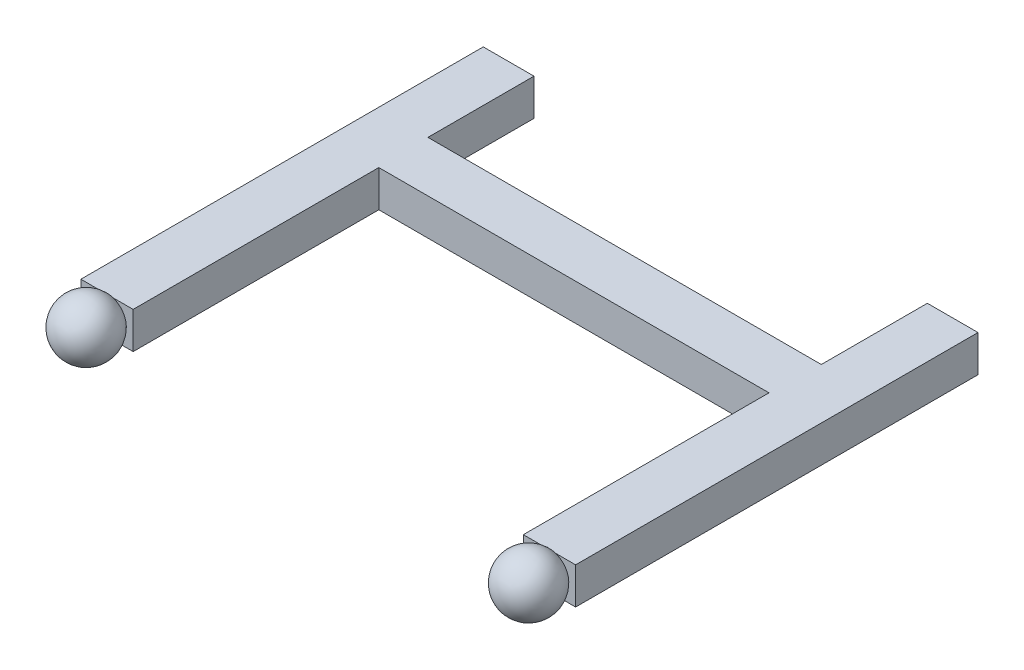
ISO-10303-21;
HEADER;
FILE_DESCRIPTION(('STEP AP214'),'2;1');
FILE_NAME('part.step','',(''),(''),'','','');
FILE_SCHEMA(('AUTOMOTIVE_DESIGN { 1 0 10303 214 1 1 1 1 }'));
ENDSEC;
DATA;
#1=APPLICATION_CONTEXT('core data for automotive mechanical design processes');
#2=APPLICATION_PROTOCOL_DEFINITION('international standard','automotive_design',2000,#1);
#3=PRODUCT_CONTEXT('',#1,'mechanical');
#4=PRODUCT('Part','Part','',(#3));
#5=PRODUCT_RELATED_PRODUCT_CATEGORY('part','',(#4));
#6=PRODUCT_DEFINITION_FORMATION('','',#4);
#7=PRODUCT_DEFINITION_CONTEXT('part definition',#1,'design');
#8=PRODUCT_DEFINITION('design','',#6,#7);
#9=PRODUCT_DEFINITION_SHAPE('','',#8);
#10=(LENGTH_UNIT() NAMED_UNIT(*) SI_UNIT(.MILLI.,.METRE.));
#11=(NAMED_UNIT(*) PLANE_ANGLE_UNIT() SI_UNIT($,.RADIAN.));
#12=(NAMED_UNIT(*) SI_UNIT($,.STERADIAN.) SOLID_ANGLE_UNIT());
#13=UNCERTAINTY_MEASURE_WITH_UNIT(LENGTH_MEASURE(1.E-05),#10,'distance_accuracy_value','');
#14=(GEOMETRIC_REPRESENTATION_CONTEXT(3) GLOBAL_UNCERTAINTY_ASSIGNED_CONTEXT((#13)) GLOBAL_UNIT_ASSIGNED_CONTEXT((#10,
#11,#12)) REPRESENTATION_CONTEXT('',''));
#15=CARTESIAN_POINT('',(0.,0.,0.));
#16=DIRECTION('',(0.,0.,1.));
#17=DIRECTION('',(1.,0.,0.));
#18=AXIS2_PLACEMENT_3D('',#15,#16,#17);
#19=CARTESIAN_POINT('',(419.201637164409,7.,96.46));
#20=DIRECTION('',(0.,0.,-1.));
#21=DIRECTION('',(-1.,0.,0.));
#22=AXIS2_PLACEMENT_3D('',#19,#20,#21);
#23=PLANE('',#22);
#24=DIRECTION('',(0.,-1.,0.));
#25=VECTOR('',#24,1.);
#26=CARTESIAN_POINT('',(409.201637164409,7.,96.4600000000001));
#27=LINE('',#26,#25);
#28=CARTESIAN_POINT('',(409.201637164409,7.,96.46));
#29=VERTEX_POINT('',#28);
#30=CARTESIAN_POINT('',(409.201637164409,0.,96.46));
#31=VERTEX_POINT('',#30);
#32=EDGE_CURVE('E58',#29,#31,#27,.T.);
#33=ORIENTED_EDGE('',*,*,#32,.F.);
#34=DIRECTION('',(1.,0.,0.));
#35=VECTOR('',#34,1.);
#36=CARTESIAN_POINT('',(419.201637164409,7.,96.46));
#37=LINE('',#36,#35);
#38=CARTESIAN_POINT('',(334.545159977184,7.,96.4600000000001));
#39=VERTEX_POINT('',#38);
#40=EDGE_CURVE('E203',#39,#29,#37,.T.);
#41=ORIENTED_EDGE('',*,*,#40,.F.);
#42=DIRECTION('',(0.,1.,0.));
#43=VECTOR('',#42,1.);
#44=CARTESIAN_POINT('',(334.545159977184,7.,96.4600000000001));
#45=LINE('',#44,#43);
#46=CARTESIAN_POINT('',(334.545159977184,0.,96.46));
#47=VERTEX_POINT('',#46);
#48=EDGE_CURVE('E206',#47,#39,#45,.T.);
#49=ORIENTED_EDGE('',*,*,#48,.F.);
#50=DIRECTION('',(1.,0.,0.));
#51=VECTOR('',#50,1.);
#52=CARTESIAN_POINT('',(419.201637164409,0.,96.46));
#53=LINE('',#52,#51);
#54=EDGE_CURVE('E358',#47,#31,#53,.T.);
#55=ORIENTED_EDGE('',*,*,#54,.T.);
#56=EDGE_LOOP('',(#33,#41,#49,#55));
#57=FACE_BOUND('',#56,.T.);
#58=ADVANCED_FACE('F35',(#57),#23,.F.);
#59=CARTESIAN_POINT('',(324.545159977184,7.,66.47));
#60=DIRECTION('',(0.,0.,1.));
#61=DIRECTION('',(1.,0.,0.));
#62=AXIS2_PLACEMENT_3D('',#59,#60,#61);
#63=PLANE('',#62);
#64=DIRECTION('',(-1.,0.,0.));
#65=VECTOR('',#64,1.);
#66=CARTESIAN_POINT('',(324.545159977184,7.,66.47));
#67=LINE('',#66,#65);
#68=CARTESIAN_POINT('',(334.245159977184,7.,66.47));
#69=VERTEX_POINT('',#68);
#70=CARTESIAN_POINT('',(324.545159977184,7.,66.47));
#71=VERTEX_POINT('',#70);
#72=EDGE_CURVE('E344',#69,#71,#67,.T.);
#73=ORIENTED_EDGE('',*,*,#72,.F.);
#74=DIRECTION('',(0.,1.,0.));
#75=VECTOR('',#74,1.);
#76=CARTESIAN_POINT('',(334.245159977184,-77.,66.47));
#77=LINE('',#76,#75);
#78=CARTESIAN_POINT('',(334.245159977184,0.,66.47));
#79=VERTEX_POINT('',#78);
#80=EDGE_CURVE('E326',#79,#69,#77,.T.);
#81=ORIENTED_EDGE('',*,*,#80,.F.);
#82=DIRECTION('',(-1.,0.,0.));
#83=VECTOR('',#82,1.);
#84=CARTESIAN_POINT('',(324.545159977184,0.,66.47));
#85=LINE('',#84,#83);
#86=CARTESIAN_POINT('',(324.545159977184,0.,66.47));
#87=VERTEX_POINT('',#86);
#88=EDGE_CURVE('E343',#79,#87,#85,.T.);
#89=ORIENTED_EDGE('',*,*,#88,.T.);
#90=DIRECTION('',(0.,-1.,0.));
#91=VECTOR('',#90,1.);
#92=CARTESIAN_POINT('',(324.545159977184,7.,66.47));
#93=LINE('',#92,#91);
#94=EDGE_CURVE('E366',#71,#87,#93,.T.);
#95=ORIENTED_EDGE('',*,*,#94,.F.);
#96=EDGE_LOOP('',(#73,#81,#89,#95));
#97=FACE_BOUND('',#96,.T.);
#98=ADVANCED_FACE('F37',(#97),#63,.F.);
#99=CARTESIAN_POINT('',(324.545159977184,7.,96.46));
#100=DIRECTION('',(1.,0.,0.));
#101=DIRECTION('',(0.,0.,-1.));
#102=AXIS2_PLACEMENT_3D('',#99,#100,#101);
#103=PLANE('',#102);
#104=DIRECTION('',(0.,0.,1.));
#105=VECTOR('',#104,1.);
#106=CARTESIAN_POINT('',(324.545159977184,0.,96.46));
#107=LINE('',#106,#105);
#108=CARTESIAN_POINT('',(324.545159977184,0.,143.46));
#109=VERTEX_POINT('',#108);
#110=EDGE_CURVE('E356',#87,#109,#107,.T.);
#111=ORIENTED_EDGE('',*,*,#110,.T.);
#112=DIRECTION('',(0.,1.,0.));
#113=VECTOR('',#112,1.);
#114=CARTESIAN_POINT('',(324.545159977184,7.,143.46));
#115=LINE('',#114,#113);
#116=CARTESIAN_POINT('',(324.545159977184,7.,143.46));
#117=VERTEX_POINT('',#116);
#118=EDGE_CURVE('E267',#109,#117,#115,.T.);
#119=ORIENTED_EDGE('',*,*,#118,.T.);
#120=DIRECTION('',(0.,0.,1.));
#121=VECTOR('',#120,1.);
#122=CARTESIAN_POINT('',(324.545159977184,7.,96.46));
#123=LINE('',#122,#121);
#124=EDGE_CURVE('E346',#71,#117,#123,.T.);
#125=ORIENTED_EDGE('',*,*,#124,.F.);
#126=ORIENTED_EDGE('',*,*,#94,.T.);
#127=EDGE_LOOP('',(#111,#119,#125,#126));
#128=FACE_BOUND('',#127,.T.);
#129=ADVANCED_FACE('F390',(#128),#103,.F.);
#130=CARTESIAN_POINT('',(419.201637164409,7.,66.47));
#131=DIRECTION('',(-1.,0.,0.));
#132=DIRECTION('',(0.,0.,1.));
#133=AXIS2_PLACEMENT_3D('',#130,#131,#132);
#134=PLANE('',#133);
#135=DIRECTION('',(0.,0.,-1.));
#136=VECTOR('',#135,1.);
#137=CARTESIAN_POINT('',(419.201637164409,0.,66.47));
#138=LINE('',#137,#136);
#139=CARTESIAN_POINT('',(419.201637164409,0.,143.46));
#140=VERTEX_POINT('',#139);
#141=CARTESIAN_POINT('',(419.201637164409,0.,66.47));
#142=VERTEX_POINT('',#141);
#143=EDGE_CURVE('E360',#140,#142,#138,.T.);
#144=ORIENTED_EDGE('',*,*,#143,.T.);
#145=DIRECTION('',(0.,-1.,0.));
#146=VECTOR('',#145,1.);
#147=CARTESIAN_POINT('',(419.201637164409,7.,66.47));
#148=LINE('',#147,#146);
#149=CARTESIAN_POINT('',(419.201637164409,7.,66.47));
#150=VERTEX_POINT('',#149);
#151=EDGE_CURVE('E354',#150,#142,#148,.T.);
#152=ORIENTED_EDGE('',*,*,#151,.F.);
#153=DIRECTION('',(0.,0.,-1.));
#154=VECTOR('',#153,1.);
#155=CARTESIAN_POINT('',(419.201637164409,7.,66.47));
#156=LINE('',#155,#154);
#157=CARTESIAN_POINT('',(419.201637164409,7.,143.46));
#158=VERTEX_POINT('',#157);
#159=EDGE_CURVE('E350',#158,#150,#156,.T.);
#160=ORIENTED_EDGE('',*,*,#159,.F.);
#161=DIRECTION('',(0.,-1.,0.));
#162=VECTOR('',#161,1.);
#163=CARTESIAN_POINT('',(419.201637164409,7.,143.46));
#164=LINE('',#163,#162);
#165=EDGE_CURVE('E216',#158,#140,#164,.T.);
#166=ORIENTED_EDGE('',*,*,#165,.T.);
#167=EDGE_LOOP('',(#144,#152,#160,#166));
#168=FACE_BOUND('',#167,.T.);
#169=ADVANCED_FACE('F453',(#168),#134,.F.);
#170=CARTESIAN_POINT('',(409.201637164409,7.,66.47));
#171=DIRECTION('',(0.,0.,1.));
#172=DIRECTION('',(1.,0.,0.));
#173=AXIS2_PLACEMENT_3D('',#170,#171,#172);
#174=PLANE('',#173);
#175=DIRECTION('',(-1.,0.,0.));
#176=VECTOR('',#175,1.);
#177=CARTESIAN_POINT('',(409.201637164409,0.,66.47));
#178=LINE('',#177,#176);
#179=CARTESIAN_POINT('',(409.512200166775,0.,66.47));
#180=VERTEX_POINT('',#179);
#181=EDGE_CURVE('E347',#142,#180,#178,.T.);
#182=ORIENTED_EDGE('',*,*,#181,.T.);
#183=DIRECTION('',(0.,1.,0.));
#184=VECTOR('',#183,1.);
#185=CARTESIAN_POINT('',(409.512200166775,-77.,66.47));
#186=LINE('',#185,#184);
#187=CARTESIAN_POINT('',(409.512200166775,7.,66.47));
#188=VERTEX_POINT('',#187);
#189=EDGE_CURVE('E327',#180,#188,#186,.T.);
#190=ORIENTED_EDGE('',*,*,#189,.T.);
#191=DIRECTION('',(-1.,0.,0.));
#192=VECTOR('',#191,1.);
#193=CARTESIAN_POINT('',(409.201637164409,7.,66.47));
#194=LINE('',#193,#192);
#195=EDGE_CURVE('E352',#150,#188,#194,.T.);
#196=ORIENTED_EDGE('',*,*,#195,.F.);
#197=ORIENTED_EDGE('',*,*,#151,.T.);
#198=EDGE_LOOP('',(#182,#190,#196,#197));
#199=FACE_BOUND('',#198,.T.);
#200=ADVANCED_FACE('F459',(#199),#174,.F.);
#201=CARTESIAN_POINT('',(0.,7.,0.));
#202=DIRECTION('',(0.,-1.,0.));
#203=DIRECTION('',(0.,0.,-1.));
#204=AXIS2_PLACEMENT_3D('',#201,#202,#203);
#205=PLANE('',#204);
#206=ORIENTED_EDGE('',*,*,#195,.T.);
#207=DIRECTION('',(0.,0.,-1.));
#208=VECTOR('',#207,1.);
#209=CARTESIAN_POINT('',(409.512200166775,7.,66.47));
#210=LINE('',#209,#208);
#211=CARTESIAN_POINT('',(409.512200166775,7.,86.76));
#212=VERTEX_POINT('',#211);
#213=EDGE_CURVE('E324',#212,#188,#210,.T.);
#214=ORIENTED_EDGE('',*,*,#213,.F.);
#215=DIRECTION('',(1.,0.,0.));
#216=VECTOR('',#215,1.);
#217=CARTESIAN_POINT('',(334.245159977184,7.,86.76));
#218=LINE('',#217,#216);
#219=CARTESIAN_POINT('',(334.245159977184,7.,86.76));
#220=VERTEX_POINT('',#219);
#221=EDGE_CURVE('E321',#220,#212,#218,.T.);
#222=ORIENTED_EDGE('',*,*,#221,.F.);
#223=DIRECTION('',(0.,0.,1.));
#224=VECTOR('',#223,1.);
#225=CARTESIAN_POINT('',(334.245159977184,7.,66.47));
#226=LINE('',#225,#224);
#227=EDGE_CURVE('E318',#69,#220,#226,.T.);
#228=ORIENTED_EDGE('',*,*,#227,.F.);
#229=ORIENTED_EDGE('',*,*,#72,.T.);
#230=ORIENTED_EDGE('',*,*,#124,.T.);
#231=DIRECTION('',(1.,0.,0.));
#232=VECTOR('',#231,1.);
#233=CARTESIAN_POINT('',(334.545159977184,7.,143.46));
#234=LINE('',#233,#232);
#235=CARTESIAN_POINT('',(328.370044287449,7.,143.46));
#236=VERTEX_POINT('',#235);
#237=EDGE_CURVE('E272',#117,#236,#234,.T.);
#238=ORIENTED_EDGE('',*,*,#237,.T.);
#239=CARTESIAN_POINT('',(330.720275666919,7.,143.46));
#240=VERTEX_POINT('',#239);
#241=EDGE_CURVE('E276',#236,#240,#234,.T.);
#242=ORIENTED_EDGE('',*,*,#241,.T.);
#243=CARTESIAN_POINT('',(334.545159977184,7.,143.46));
#244=VERTEX_POINT('',#243);
#245=EDGE_CURVE('E271',#240,#244,#234,.T.);
#246=ORIENTED_EDGE('',*,*,#245,.T.);
#247=DIRECTION('',(0.,0.,-1.));
#248=VECTOR('',#247,1.);
#249=CARTESIAN_POINT('',(334.545159977184,7.,142.46));
#250=LINE('',#249,#248);
#251=EDGE_CURVE('E338',#244,#39,#250,.T.);
#252=ORIENTED_EDGE('',*,*,#251,.T.);
#253=ORIENTED_EDGE('',*,*,#40,.T.);
#254=DIRECTION('',(0.,0.,-1.));
#255=VECTOR('',#254,1.);
#256=CARTESIAN_POINT('',(409.201637164409,7.,142.46));
#257=LINE('',#256,#255);
#258=CARTESIAN_POINT('',(409.201637164409,7.,143.46));
#259=VERTEX_POINT('',#258);
#260=EDGE_CURVE('E195',#259,#29,#257,.T.);
#261=ORIENTED_EDGE('',*,*,#260,.F.);
#262=DIRECTION('',(1.,0.,0.));
#263=VECTOR('',#262,1.);
#264=CARTESIAN_POINT('',(419.201637164409,7.,143.46));
#265=LINE('',#264,#263);
#266=CARTESIAN_POINT('',(413.026521474673,7.,143.46));
#267=VERTEX_POINT('',#266);
#268=EDGE_CURVE('E200',#259,#267,#265,.T.);
#269=ORIENTED_EDGE('',*,*,#268,.T.);
#270=CARTESIAN_POINT('',(415.376752854144,7.,143.46));
#271=VERTEX_POINT('',#270);
#272=EDGE_CURVE('E217',#267,#271,#265,.T.);
#273=ORIENTED_EDGE('',*,*,#272,.T.);
#274=EDGE_CURVE('E219',#271,#158,#265,.T.);
#275=ORIENTED_EDGE('',*,*,#274,.T.);
#276=ORIENTED_EDGE('',*,*,#159,.T.);
#277=EDGE_LOOP('',(#206,#214,#222,#228,#229,#230,#238,#242,#246,#252,#253,#261,#269,#273,#275,#276));
#278=FACE_BOUND('',#277,.T.);
#279=ADVANCED_FACE('F198',(#278),#205,.F.);
#280=CARTESIAN_POINT('',(0.,0.,0.));
#281=DIRECTION('',(0.,-1.,0.));
#282=DIRECTION('',(0.,0.,-1.));
#283=AXIS2_PLACEMENT_3D('',#280,#281,#282);
#284=PLANE('',#283);
#285=DIRECTION('',(0.,0.,1.));
#286=VECTOR('',#285,1.);
#287=CARTESIAN_POINT('',(409.512200166775,0.,0.));
#288=LINE('',#287,#286);
#289=CARTESIAN_POINT('',(409.512200166775,0.,86.76));
#290=VERTEX_POINT('',#289);
#291=EDGE_CURVE('E11',#180,#290,#288,.T.);
#292=ORIENTED_EDGE('',*,*,#291,.F.);
#293=ORIENTED_EDGE('',*,*,#181,.F.);
#294=ORIENTED_EDGE('',*,*,#143,.F.);
#295=DIRECTION('',(-1.,0.,0.));
#296=VECTOR('',#295,1.);
#297=CARTESIAN_POINT('',(419.201637164409,0.,143.46));
#298=LINE('',#297,#296);
#299=CARTESIAN_POINT('',(415.376752854144,0.,143.46));
#300=VERTEX_POINT('',#299);
#301=EDGE_CURVE('E229',#140,#300,#298,.T.);
#302=ORIENTED_EDGE('',*,*,#301,.T.);
#303=CARTESIAN_POINT('',(413.026521474673,0.,143.46));
#304=VERTEX_POINT('',#303);
#305=EDGE_CURVE('E233',#300,#304,#298,.T.);
#306=ORIENTED_EDGE('',*,*,#305,.T.);
#307=CARTESIAN_POINT('',(409.201637164409,0.,143.46));
#308=VERTEX_POINT('',#307);
#309=EDGE_CURVE('E228',#304,#308,#298,.T.);
#310=ORIENTED_EDGE('',*,*,#309,.T.);
#311=DIRECTION('',(0.,0.,-1.));
#312=VECTOR('',#311,1.);
#313=CARTESIAN_POINT('',(409.201637164409,0.,142.46));
#314=LINE('',#313,#312);
#315=EDGE_CURVE('E207',#308,#31,#314,.T.);
#316=ORIENTED_EDGE('',*,*,#315,.T.);
#317=ORIENTED_EDGE('',*,*,#54,.F.);
#318=DIRECTION('',(0.,0.,-1.));
#319=VECTOR('',#318,1.);
#320=CARTESIAN_POINT('',(334.545159977184,0.,142.46));
#321=LINE('',#320,#319);
#322=CARTESIAN_POINT('',(334.545159977184,0.,143.46));
#323=VERTEX_POINT('',#322);
#324=EDGE_CURVE('E340',#323,#47,#321,.T.);
#325=ORIENTED_EDGE('',*,*,#324,.F.);
#326=DIRECTION('',(-1.,0.,0.));
#327=VECTOR('',#326,1.);
#328=CARTESIAN_POINT('',(334.545159977184,0.,143.46));
#329=LINE('',#328,#327);
#330=CARTESIAN_POINT('',(330.720275666919,0.,143.46));
#331=VERTEX_POINT('',#330);
#332=EDGE_CURVE('E280',#323,#331,#329,.T.);
#333=ORIENTED_EDGE('',*,*,#332,.T.);
#334=CARTESIAN_POINT('',(328.370044287449,0.,143.46));
#335=VERTEX_POINT('',#334);
#336=EDGE_CURVE('E284',#331,#335,#329,.T.);
#337=ORIENTED_EDGE('',*,*,#336,.T.);
#338=EDGE_CURVE('E279',#335,#109,#329,.T.);
#339=ORIENTED_EDGE('',*,*,#338,.T.);
#340=ORIENTED_EDGE('',*,*,#110,.F.);
#341=ORIENTED_EDGE('',*,*,#88,.F.);
#342=DIRECTION('',(0.,0.,-1.));
#343=VECTOR('',#342,1.);
#344=CARTESIAN_POINT('',(334.245159977184,0.,0.));
#345=LINE('',#344,#343);
#346=CARTESIAN_POINT('',(334.245159977184,0.,86.76));
#347=VERTEX_POINT('',#346);
#348=EDGE_CURVE('E369',#347,#79,#345,.T.);
#349=ORIENTED_EDGE('',*,*,#348,.F.);
#350=DIRECTION('',(-1.,0.,0.));
#351=VECTOR('',#350,1.);
#352=CARTESIAN_POINT('',(0.,0.,86.76));
#353=LINE('',#352,#351);
#354=EDGE_CURVE('E43',#290,#347,#353,.T.);
#355=ORIENTED_EDGE('',*,*,#354,.F.);
#356=EDGE_LOOP('',(#292,#293,#294,#302,#306,#310,#316,#317,#325,#333,#337,#339,#340,#341,#349,#355));
#357=FACE_BOUND('',#356,.T.);
#358=ADVANCED_FACE('F378',(#357),#284,.T.);
#359=CARTESIAN_POINT('',(334.545159977184,7.,142.46));
#360=DIRECTION('',(-1.,0.,0.));
#361=DIRECTION('',(0.,0.,1.));
#362=AXIS2_PLACEMENT_3D('',#359,#360,#361);
#363=PLANE('',#362);
#364=ORIENTED_EDGE('',*,*,#48,.T.);
#365=ORIENTED_EDGE('',*,*,#251,.F.);
#366=DIRECTION('',(0.,-1.,0.));
#367=VECTOR('',#366,1.);
#368=CARTESIAN_POINT('',(334.545159977184,7.,143.46));
#369=LINE('',#368,#367);
#370=EDGE_CURVE('E275',#244,#323,#369,.T.);
#371=ORIENTED_EDGE('',*,*,#370,.T.);
#372=ORIENTED_EDGE('',*,*,#324,.T.);
#373=EDGE_LOOP('',(#364,#365,#371,#372));
#374=FACE_BOUND('',#373,.T.);
#375=ADVANCED_FACE('F564',(#374),#363,.F.);
#376=CARTESIAN_POINT('',(409.201637164409,7.,142.46));
#377=DIRECTION('',(1.,0.,0.));
#378=DIRECTION('',(0.,0.,-1.));
#379=AXIS2_PLACEMENT_3D('',#376,#377,#378);
#380=PLANE('',#379);
#381=ORIENTED_EDGE('',*,*,#32,.T.);
#382=ORIENTED_EDGE('',*,*,#315,.F.);
#383=DIRECTION('',(0.,1.,0.));
#384=VECTOR('',#383,1.);
#385=CARTESIAN_POINT('',(409.201637164409,7.,143.46));
#386=LINE('',#385,#384);
#387=EDGE_CURVE('E213',#308,#259,#386,.T.);
#388=ORIENTED_EDGE('',*,*,#387,.T.);
#389=ORIENTED_EDGE('',*,*,#260,.T.);
#390=EDGE_LOOP('',(#381,#382,#388,#389));
#391=FACE_BOUND('',#390,.T.);
#392=ADVANCED_FACE('F220',(#391),#380,.F.);
#393=CARTESIAN_POINT('',(409.512200166775,-77.,66.47));
#394=DIRECTION('',(1.,0.,0.));
#395=DIRECTION('',(0.,0.,-1.));
#396=AXIS2_PLACEMENT_3D('',#393,#394,#395);
#397=PLANE('',#396);
#398=ORIENTED_EDGE('',*,*,#291,.T.);
#399=DIRECTION('',(0.,1.,0.));
#400=VECTOR('',#399,1.);
#401=CARTESIAN_POINT('',(409.512200166775,-77.,86.76));
#402=LINE('',#401,#400);
#403=EDGE_CURVE('E330',#290,#212,#402,.T.);
#404=ORIENTED_EDGE('',*,*,#403,.T.);
#405=ORIENTED_EDGE('',*,*,#213,.T.);
#406=ORIENTED_EDGE('',*,*,#189,.F.);
#407=EDGE_LOOP('',(#398,#404,#405,#406));
#408=FACE_BOUND('',#407,.T.);
#409=ADVANCED_FACE('F471',(#408),#397,.F.);
#410=CARTESIAN_POINT('',(334.245159977184,-77.,86.76));
#411=DIRECTION('',(0.,0.,1.));
#412=DIRECTION('',(1.,0.,0.));
#413=AXIS2_PLACEMENT_3D('',#410,#411,#412);
#414=PLANE('',#413);
#415=ORIENTED_EDGE('',*,*,#354,.T.);
#416=DIRECTION('',(0.,1.,0.));
#417=VECTOR('',#416,1.);
#418=CARTESIAN_POINT('',(334.245159977184,-77.,86.76));
#419=LINE('',#418,#417);
#420=EDGE_CURVE('E50',#347,#220,#419,.T.);
#421=ORIENTED_EDGE('',*,*,#420,.T.);
#422=ORIENTED_EDGE('',*,*,#221,.T.);
#423=ORIENTED_EDGE('',*,*,#403,.F.);
#424=EDGE_LOOP('',(#415,#421,#422,#423));
#425=FACE_BOUND('',#424,.T.);
#426=ADVANCED_FACE('F374',(#425),#414,.F.);
#427=CARTESIAN_POINT('',(334.245159977184,-77.,66.47));
#428=DIRECTION('',(-1.,0.,0.));
#429=DIRECTION('',(0.,0.,1.));
#430=AXIS2_PLACEMENT_3D('',#427,#428,#429);
#431=PLANE('',#430);
#432=ORIENTED_EDGE('',*,*,#348,.T.);
#433=ORIENTED_EDGE('',*,*,#80,.T.);
#434=ORIENTED_EDGE('',*,*,#227,.T.);
#435=ORIENTED_EDGE('',*,*,#420,.F.);
#436=EDGE_LOOP('',(#432,#433,#434,#435));
#437=FACE_BOUND('',#436,.T.);
#438=ADVANCED_FACE('F381',(#437),#431,.F.);
#439=CARTESIAN_POINT('',(643.313137293382,108.507876991878,143.46));
#440=DIRECTION('',(0.,0.,-1.));
#441=DIRECTION('',(-0.923728021347068,-0.383049008063238,0.));
#442=AXIS2_PLACEMENT_3D('',#439,#440,#441);
#443=PLANE('',#442);
#444=CARTESIAN_POINT('',(329.545159977184,3.5,143.46));
#445=DIRECTION('',(0.,0.,-1.));
#446=DIRECTION('',(-0.923728021347068,-0.383049008063238,0.));
#447=AXIS2_PLACEMENT_3D('',#444,#445,#446);
#448=CIRCLE('',#447,3.69200445344563);
#449=CARTESIAN_POINT('',(329.081850035039,7.16281869354349,143.46));
#450=VERTEX_POINT('',#449);
#451=EDGE_CURVE('E314',#240,#450,#448,.F.);
#452=ORIENTED_EDGE('',*,*,#451,.F.);
#453=ORIENTED_EDGE('',*,*,#241,.F.);
#454=CARTESIAN_POINT('',(329.077623369646,7.16228158459646,143.46));
#455=VERTEX_POINT('',#454);
#456=EDGE_CURVE('E319',#455,#236,#448,.F.);
#457=ORIENTED_EDGE('',*,*,#456,.F.);
#458=DIRECTION('',(-1.,0.,0.));
#459=VECTOR('',#458,1.);
#460=CARTESIAN_POINT('',(329.081850035039,7.16228158459646,143.46));
#461=LINE('',#460,#459);
#462=CARTESIAN_POINT('',(329.081850035039,7.16228158459646,143.46));
#463=VERTEX_POINT('',#462);
#464=EDGE_CURVE('E297',#463,#455,#461,.T.);
#465=ORIENTED_EDGE('',*,*,#464,.F.);
#466=DIRECTION('',(0.,-1.,0.));
#467=VECTOR('',#466,1.);
#468=CARTESIAN_POINT('',(329.081850035039,7.16281869354349,143.46));
#469=LINE('',#468,#467);
#470=EDGE_CURVE('E283',#450,#463,#469,.T.);
#471=ORIENTED_EDGE('',*,*,#470,.F.);
#472=EDGE_LOOP('',(#452,#453,#457,#465,#471));
#473=FACE_BOUND('',#472,.T.);
#474=ADVANCED_FACE('F406',(#473),#443,.T.);
#475=EDGE_CURVE('E414',#335,#331,#448,.F.);
#476=ORIENTED_EDGE('',*,*,#475,.F.);
#477=ORIENTED_EDGE('',*,*,#336,.F.);
#478=EDGE_LOOP('',(#476,#477));
#479=FACE_BOUND('',#478,.T.);
#480=ADVANCED_FACE('F545',(#479),#443,.T.);
#481=CARTESIAN_POINT('',(329.545159977184,3.5,147.46));
#482=DIRECTION('',(-0.383049008063238,0.923728021347068,0.));
#483=DIRECTION('',(-0.923728021347068,-0.383049008063238,0.));
#484=AXIS2_PLACEMENT_3D('',#481,#482,#483);
#485=SPHERICAL_SURFACE('',#484,5.44342694304447);
#486=CARTESIAN_POINT('',(329.545159977184,3.5,147.46));
#487=DIRECTION('',(0.,0.,-1.));
#488=DIRECTION('',(-0.923728021347068,-0.383049008063238,0.));
#489=AXIS2_PLACEMENT_3D('',#486,#487,#488);
#490=SPHERICAL_SURFACE('',#489,5.44342694304447);
#491=EDGE_CURVE('E315',#450,#455,#448,.F.);
#492=ORIENTED_EDGE('',*,*,#491,.T.);
#493=ORIENTED_EDGE('',*,*,#456,.T.);
#494=EDGE_CURVE('E398',#236,#335,#448,.F.);
#495=ORIENTED_EDGE('',*,*,#494,.T.);
#496=ORIENTED_EDGE('',*,*,#475,.T.);
#497=EDGE_CURVE('E415',#331,#240,#448,.F.);
#498=ORIENTED_EDGE('',*,*,#497,.T.);
#499=ORIENTED_EDGE('',*,*,#451,.T.);
#500=EDGE_LOOP('',(#492,#493,#495,#496,#498,#499));
#501=FACE_BOUND('',#500,.T.);
#502=ADVANCED_FACE('F411',(#501),#490,.T.);
#503=CARTESIAN_POINT('',(329.081850035039,7.16281869354349,142.46));
#504=DIRECTION('',(-1.,0.,0.));
#505=DIRECTION('',(0.,0.,1.));
#506=AXIS2_PLACEMENT_3D('',#503,#504,#505);
#507=PLANE('',#506);
#508=ORIENTED_EDGE('',*,*,#470,.T.);
#509=DIRECTION('',(0.,0.,1.));
#510=VECTOR('',#509,1.);
#511=CARTESIAN_POINT('',(329.081850035039,7.16228158459646,142.46));
#512=LINE('',#511,#510);
#513=CARTESIAN_POINT('',(329.081850035039,7.16228158459646,142.46));
#514=VERTEX_POINT('',#513);
#515=EDGE_CURVE('E311',#514,#463,#512,.T.);
#516=ORIENTED_EDGE('',*,*,#515,.F.);
#517=DIRECTION('',(0.,-1.,0.));
#518=VECTOR('',#517,1.);
#519=CARTESIAN_POINT('',(329.081850035039,7.16281869354349,142.46));
#520=LINE('',#519,#518);
#521=CARTESIAN_POINT('',(329.081850035039,7.16281869354349,142.46));
#522=VERTEX_POINT('',#521);
#523=EDGE_CURVE('E285',#522,#514,#520,.T.);
#524=ORIENTED_EDGE('',*,*,#523,.F.);
#525=DIRECTION('',(0.,0.,1.));
#526=VECTOR('',#525,1.);
#527=CARTESIAN_POINT('',(329.081850035039,7.16281869354349,142.46));
#528=LINE('',#527,#526);
#529=EDGE_CURVE('E295',#522,#450,#528,.T.);
#530=ORIENTED_EDGE('',*,*,#529,.T.);
#531=EDGE_LOOP('',(#508,#516,#524,#530));
#532=FACE_BOUND('',#531,.T.);
#533=ADVANCED_FACE('F427',(#532),#507,.F.);
#534=CARTESIAN_POINT('',(329.081850035039,7.16228158459646,142.46));
#535=DIRECTION('',(0.,1.,0.));
#536=DIRECTION('',(0.,0.,1.));
#537=AXIS2_PLACEMENT_3D('',#534,#535,#536);
#538=PLANE('',#537);
#539=ORIENTED_EDGE('',*,*,#464,.T.);
#540=DIRECTION('',(0.,0.,1.));
#541=VECTOR('',#540,1.);
#542=CARTESIAN_POINT('',(329.077623369646,7.16228158459646,142.46));
#543=LINE('',#542,#541);
#544=CARTESIAN_POINT('',(329.077623369646,7.16228158459646,142.46));
#545=VERTEX_POINT('',#544);
#546=EDGE_CURVE('E308',#545,#455,#543,.T.);
#547=ORIENTED_EDGE('',*,*,#546,.F.);
#548=DIRECTION('',(-1.,0.,0.));
#549=VECTOR('',#548,1.);
#550=CARTESIAN_POINT('',(329.081850035039,7.16228158459646,142.46));
#551=LINE('',#550,#549);
#552=EDGE_CURVE('E288',#514,#545,#551,.T.);
#553=ORIENTED_EDGE('',*,*,#552,.F.);
#554=ORIENTED_EDGE('',*,*,#515,.T.);
#555=EDGE_LOOP('',(#539,#547,#553,#554));
#556=FACE_BOUND('',#555,.T.);
#557=ADVANCED_FACE('F431',(#556),#538,.F.);
#558=CARTESIAN_POINT('',(329.077623369646,7.16281869354349,142.46));
#559=DIRECTION('',(1.,0.,0.));
#560=DIRECTION('',(0.,0.,-1.));
#561=AXIS2_PLACEMENT_3D('',#558,#559,#560);
#562=PLANE('',#561);
#563=DIRECTION('',(0.,1.,0.));
#564=VECTOR('',#563,1.);
#565=CARTESIAN_POINT('',(329.077623369646,7.16281869354349,143.46));
#566=LINE('',#565,#564);
#567=CARTESIAN_POINT('',(329.077623369646,7.16281869354349,143.46));
#568=VERTEX_POINT('',#567);
#569=EDGE_CURVE('E299',#455,#568,#566,.T.);
#570=ORIENTED_EDGE('',*,*,#569,.T.);
#571=DIRECTION('',(0.,0.,1.));
#572=VECTOR('',#571,1.);
#573=CARTESIAN_POINT('',(329.077623369646,7.16281869354349,142.46));
#574=LINE('',#573,#572);
#575=CARTESIAN_POINT('',(329.077623369646,7.16281869354349,142.46));
#576=VERTEX_POINT('',#575);
#577=EDGE_CURVE('E305',#576,#568,#574,.T.);
#578=ORIENTED_EDGE('',*,*,#577,.F.);
#579=DIRECTION('',(0.,1.,0.));
#580=VECTOR('',#579,1.);
#581=CARTESIAN_POINT('',(329.077623369646,7.16281869354349,142.46));
#582=LINE('',#581,#580);
#583=EDGE_CURVE('E291',#545,#576,#582,.T.);
#584=ORIENTED_EDGE('',*,*,#583,.F.);
#585=ORIENTED_EDGE('',*,*,#546,.T.);
#586=EDGE_LOOP('',(#570,#578,#584,#585));
#587=FACE_BOUND('',#586,.T.);
#588=ADVANCED_FACE('F434',(#587),#562,.F.);
#589=CARTESIAN_POINT('',(329.081850035039,7.16281869354349,142.46));
#590=DIRECTION('',(0.,-1.,0.));
#591=DIRECTION('',(0.,0.,-1.));
#592=AXIS2_PLACEMENT_3D('',#589,#590,#591);
#593=PLANE('',#592);
#594=DIRECTION('',(1.,0.,0.));
#595=VECTOR('',#594,1.);
#596=CARTESIAN_POINT('',(329.081850035039,7.16281869354349,143.46));
#597=LINE('',#596,#595);
#598=EDGE_CURVE('E289',#568,#450,#597,.T.);
#599=ORIENTED_EDGE('',*,*,#598,.T.);
#600=ORIENTED_EDGE('',*,*,#529,.F.);
#601=DIRECTION('',(1.,0.,0.));
#602=VECTOR('',#601,1.);
#603=CARTESIAN_POINT('',(329.081850035039,7.16281869354349,142.46));
#604=LINE('',#603,#602);
#605=EDGE_CURVE('E293',#576,#522,#604,.T.);
#606=ORIENTED_EDGE('',*,*,#605,.F.);
#607=ORIENTED_EDGE('',*,*,#577,.T.);
#608=EDGE_LOOP('',(#599,#600,#606,#607));
#609=FACE_BOUND('',#608,.T.);
#610=ADVANCED_FACE('F422',(#609),#593,.F.);
#611=CARTESIAN_POINT('',(643.313137293382,108.507876991878,142.46));
#612=DIRECTION('',(0.,0.,-1.));
#613=DIRECTION('',(-1.,0.,0.));
#614=AXIS2_PLACEMENT_3D('',#611,#612,#613);
#615=PLANE('',#614);
#616=ORIENTED_EDGE('',*,*,#523,.T.);
#617=ORIENTED_EDGE('',*,*,#552,.T.);
#618=ORIENTED_EDGE('',*,*,#583,.T.);
#619=ORIENTED_EDGE('',*,*,#605,.T.);
#620=EDGE_LOOP('',(#616,#617,#618,#619));
#621=FACE_BOUND('',#620,.T.);
#622=ADVANCED_FACE('F436',(#621),#615,.T.);
#623=CARTESIAN_POINT('',(643.313137293382,108.507876991878,143.46));
#624=DIRECTION('',(0.,0.,-1.));
#625=DIRECTION('',(-1.,0.,0.));
#626=AXIS2_PLACEMENT_3D('',#623,#624,#625);
#627=PLANE('',#626);
#628=ORIENTED_EDGE('',*,*,#491,.F.);
#629=ORIENTED_EDGE('',*,*,#598,.F.);
#630=ORIENTED_EDGE('',*,*,#569,.F.);
#631=EDGE_LOOP('',(#628,#629,#630));
#632=FACE_BOUND('',#631,.T.);
#633=ADVANCED_FACE('F419',(#632),#627,.F.);
#634=CARTESIAN_POINT('',(15.7249561145322,-4.76989115287793,143.46));
#635=DIRECTION('',(0.,0.,-1.));
#636=DIRECTION('',(-1.,0.,0.));
#637=AXIS2_PLACEMENT_3D('',#634,#635,#636);
#638=PLANE('',#637);
#639=ORIENTED_EDGE('',*,*,#497,.F.);
#640=ORIENTED_EDGE('',*,*,#332,.F.);
#641=ORIENTED_EDGE('',*,*,#370,.F.);
#642=ORIENTED_EDGE('',*,*,#245,.F.);
#643=EDGE_LOOP('',(#639,#640,#641,#642));
#644=FACE_BOUND('',#643,.T.);
#645=ADVANCED_FACE('F443',(#644),#638,.F.);
#646=ORIENTED_EDGE('',*,*,#494,.F.);
#647=ORIENTED_EDGE('',*,*,#237,.F.);
#648=ORIENTED_EDGE('',*,*,#118,.F.);
#649=ORIENTED_EDGE('',*,*,#338,.F.);
#650=EDGE_LOOP('',(#646,#647,#648,#649));
#651=FACE_BOUND('',#650,.T.);
#652=ADVANCED_FACE('F395',(#651),#638,.F.);
#653=CARTESIAN_POINT('',(727.969614480606,108.507876991878,143.46));
#654=DIRECTION('',(0.,0.,-1.));
#655=DIRECTION('',(-0.923728021347068,-0.383049008063238,0.));
#656=AXIS2_PLACEMENT_3D('',#653,#654,#655);
#657=PLANE('',#656);
#658=CARTESIAN_POINT('',(414.201637164409,3.5,143.46));
#659=DIRECTION('',(0.,0.,-1.));
#660=DIRECTION('',(-0.923728021347068,-0.383049008063238,0.));
#661=AXIS2_PLACEMENT_3D('',#658,#659,#660);
#662=CIRCLE('',#661,3.69200445344563);
#663=CARTESIAN_POINT('',(413.738327222263,7.16281869354349,143.46));
#664=VERTEX_POINT('',#663);
#665=EDGE_CURVE('E263',#271,#664,#662,.F.);
#666=ORIENTED_EDGE('',*,*,#665,.F.);
#667=ORIENTED_EDGE('',*,*,#272,.F.);
#668=CARTESIAN_POINT('',(413.734100556871,7.16228158459646,143.46));
#669=VERTEX_POINT('',#668);
#670=EDGE_CURVE('E268',#669,#267,#662,.F.);
#671=ORIENTED_EDGE('',*,*,#670,.F.);
#672=DIRECTION('',(-1.,0.,0.));
#673=VECTOR('',#672,1.);
#674=CARTESIAN_POINT('',(413.738327222263,7.16228158459646,143.46));
#675=LINE('',#674,#673);
#676=CARTESIAN_POINT('',(413.738327222263,7.16228158459646,143.46));
#677=VERTEX_POINT('',#676);
#678=EDGE_CURVE('E246',#677,#669,#675,.T.);
#679=ORIENTED_EDGE('',*,*,#678,.F.);
#680=DIRECTION('',(0.,-1.,0.));
#681=VECTOR('',#680,1.);
#682=CARTESIAN_POINT('',(413.738327222263,7.16281869354349,143.46));
#683=LINE('',#682,#681);
#684=EDGE_CURVE('E232',#664,#677,#683,.T.);
#685=ORIENTED_EDGE('',*,*,#684,.F.);
#686=EDGE_LOOP('',(#666,#667,#671,#679,#685));
#687=FACE_BOUND('',#686,.T.);
#688=ADVANCED_FACE('F505',(#687),#657,.T.);
#689=EDGE_CURVE('E483',#304,#300,#662,.F.);
#690=ORIENTED_EDGE('',*,*,#689,.F.);
#691=ORIENTED_EDGE('',*,*,#305,.F.);
#692=EDGE_LOOP('',(#690,#691));
#693=FACE_BOUND('',#692,.T.);
#694=ADVANCED_FACE('F482',(#693),#657,.T.);
#695=CARTESIAN_POINT('',(414.201637164409,3.5,147.46));
#696=DIRECTION('',(-0.383049008063238,0.923728021347068,0.));
#697=DIRECTION('',(-0.923728021347068,-0.383049008063238,0.));
#698=AXIS2_PLACEMENT_3D('',#695,#696,#697);
#699=SPHERICAL_SURFACE('',#698,5.44342694304447);
#700=CARTESIAN_POINT('',(414.201637164409,3.5,147.46));
#701=DIRECTION('',(0.,0.,-1.));
#702=DIRECTION('',(-0.923728021347068,-0.383049008063238,0.));
#703=AXIS2_PLACEMENT_3D('',#700,#701,#702);
#704=SPHERICAL_SURFACE('',#703,5.44342694304447);
#705=EDGE_CURVE('E264',#664,#669,#662,.F.);
#706=ORIENTED_EDGE('',*,*,#705,.T.);
#707=ORIENTED_EDGE('',*,*,#670,.T.);
#708=EDGE_CURVE('E215',#267,#304,#662,.F.);
#709=ORIENTED_EDGE('',*,*,#708,.T.);
#710=ORIENTED_EDGE('',*,*,#689,.T.);
#711=EDGE_CURVE('E477',#300,#271,#662,.F.);
#712=ORIENTED_EDGE('',*,*,#711,.T.);
#713=ORIENTED_EDGE('',*,*,#665,.T.);
#714=EDGE_LOOP('',(#706,#707,#709,#710,#712,#713));
#715=FACE_BOUND('',#714,.T.);
#716=ADVANCED_FACE('F485',(#715),#704,.T.);
#717=CARTESIAN_POINT('',(413.738327222263,7.16281869354349,142.46));
#718=DIRECTION('',(-1.,0.,0.));
#719=DIRECTION('',(0.,0.,1.));
#720=AXIS2_PLACEMENT_3D('',#717,#718,#719);
#721=PLANE('',#720);
#722=ORIENTED_EDGE('',*,*,#684,.T.);
#723=DIRECTION('',(0.,0.,1.));
#724=VECTOR('',#723,1.);
#725=CARTESIAN_POINT('',(413.738327222263,7.16228158459646,142.46));
#726=LINE('',#725,#724);
#727=CARTESIAN_POINT('',(413.738327222263,7.16228158459646,142.46));
#728=VERTEX_POINT('',#727);
#729=EDGE_CURVE('E260',#728,#677,#726,.T.);
#730=ORIENTED_EDGE('',*,*,#729,.F.);
#731=DIRECTION('',(0.,-1.,0.));
#732=VECTOR('',#731,1.);
#733=CARTESIAN_POINT('',(413.738327222263,7.16281869354349,142.46));
#734=LINE('',#733,#732);
#735=CARTESIAN_POINT('',(413.738327222263,7.16281869354349,142.46));
#736=VERTEX_POINT('',#735);
#737=EDGE_CURVE('E234',#736,#728,#734,.T.);
#738=ORIENTED_EDGE('',*,*,#737,.F.);
#739=DIRECTION('',(0.,0.,1.));
#740=VECTOR('',#739,1.);
#741=CARTESIAN_POINT('',(413.738327222263,7.16281869354349,142.46));
#742=LINE('',#741,#740);
#743=EDGE_CURVE('E244',#736,#664,#742,.T.);
#744=ORIENTED_EDGE('',*,*,#743,.T.);
#745=EDGE_LOOP('',(#722,#730,#738,#744));
#746=FACE_BOUND('',#745,.T.);
#747=ADVANCED_FACE('F502',(#746),#721,.F.);
#748=CARTESIAN_POINT('',(413.738327222263,7.16228158459646,142.46));
#749=DIRECTION('',(0.,1.,0.));
#750=DIRECTION('',(0.,0.,1.));
#751=AXIS2_PLACEMENT_3D('',#748,#749,#750);
#752=PLANE('',#751);
#753=ORIENTED_EDGE('',*,*,#678,.T.);
#754=DIRECTION('',(0.,0.,1.));
#755=VECTOR('',#754,1.);
#756=CARTESIAN_POINT('',(413.734100556871,7.16228158459646,142.46));
#757=LINE('',#756,#755);
#758=CARTESIAN_POINT('',(413.734100556871,7.16228158459646,142.46));
#759=VERTEX_POINT('',#758);
#760=EDGE_CURVE('E257',#759,#669,#757,.T.);
#761=ORIENTED_EDGE('',*,*,#760,.F.);
#762=DIRECTION('',(-1.,0.,0.));
#763=VECTOR('',#762,1.);
#764=CARTESIAN_POINT('',(413.738327222263,7.16228158459646,142.46));
#765=LINE('',#764,#763);
#766=EDGE_CURVE('E237',#728,#759,#765,.T.);
#767=ORIENTED_EDGE('',*,*,#766,.F.);
#768=ORIENTED_EDGE('',*,*,#729,.T.);
#769=EDGE_LOOP('',(#753,#761,#767,#768));
#770=FACE_BOUND('',#769,.T.);
#771=ADVANCED_FACE('F508',(#770),#752,.F.);
#772=CARTESIAN_POINT('',(413.734100556871,7.16281869354349,142.46));
#773=DIRECTION('',(1.,0.,0.));
#774=DIRECTION('',(0.,0.,-1.));
#775=AXIS2_PLACEMENT_3D('',#772,#773,#774);
#776=PLANE('',#775);
#777=DIRECTION('',(0.,1.,0.));
#778=VECTOR('',#777,1.);
#779=CARTESIAN_POINT('',(413.734100556871,7.16281869354349,143.46));
#780=LINE('',#779,#778);
#781=CARTESIAN_POINT('',(413.734100556871,7.16281869354349,143.46));
#782=VERTEX_POINT('',#781);
#783=EDGE_CURVE('E248',#669,#782,#780,.T.);
#784=ORIENTED_EDGE('',*,*,#783,.T.);
#785=DIRECTION('',(0.,0.,1.));
#786=VECTOR('',#785,1.);
#787=CARTESIAN_POINT('',(413.734100556871,7.16281869354349,142.46));
#788=LINE('',#787,#786);
#789=CARTESIAN_POINT('',(413.734100556871,7.16281869354349,142.46));
#790=VERTEX_POINT('',#789);
#791=EDGE_CURVE('E254',#790,#782,#788,.T.);
#792=ORIENTED_EDGE('',*,*,#791,.F.);
#793=DIRECTION('',(0.,1.,0.));
#794=VECTOR('',#793,1.);
#795=CARTESIAN_POINT('',(413.734100556871,7.16281869354349,142.46));
#796=LINE('',#795,#794);
#797=EDGE_CURVE('E240',#759,#790,#796,.T.);
#798=ORIENTED_EDGE('',*,*,#797,.F.);
#799=ORIENTED_EDGE('',*,*,#760,.T.);
#800=EDGE_LOOP('',(#784,#792,#798,#799));
#801=FACE_BOUND('',#800,.T.);
#802=ADVANCED_FACE('F511',(#801),#776,.F.);
#803=CARTESIAN_POINT('',(413.738327222263,7.16281869354349,142.46));
#804=DIRECTION('',(0.,-1.,0.));
#805=DIRECTION('',(0.,0.,-1.));
#806=AXIS2_PLACEMENT_3D('',#803,#804,#805);
#807=PLANE('',#806);
#808=DIRECTION('',(1.,0.,0.));
#809=VECTOR('',#808,1.);
#810=CARTESIAN_POINT('',(413.738327222263,7.16281869354349,143.46));
#811=LINE('',#810,#809);
#812=EDGE_CURVE('E238',#782,#664,#811,.T.);
#813=ORIENTED_EDGE('',*,*,#812,.T.);
#814=ORIENTED_EDGE('',*,*,#743,.F.);
#815=DIRECTION('',(1.,0.,0.));
#816=VECTOR('',#815,1.);
#817=CARTESIAN_POINT('',(413.738327222263,7.16281869354349,142.46));
#818=LINE('',#817,#816);
#819=EDGE_CURVE('E242',#790,#736,#818,.T.);
#820=ORIENTED_EDGE('',*,*,#819,.F.);
#821=ORIENTED_EDGE('',*,*,#791,.T.);
#822=EDGE_LOOP('',(#813,#814,#820,#821));
#823=FACE_BOUND('',#822,.T.);
#824=ADVANCED_FACE('F497',(#823),#807,.F.);
#825=CARTESIAN_POINT('',(727.969614480606,108.507876991878,142.46));
#826=DIRECTION('',(0.,0.,-1.));
#827=DIRECTION('',(-1.,0.,0.));
#828=AXIS2_PLACEMENT_3D('',#825,#826,#827);
#829=PLANE('',#828);
#830=ORIENTED_EDGE('',*,*,#737,.T.);
#831=ORIENTED_EDGE('',*,*,#766,.T.);
#832=ORIENTED_EDGE('',*,*,#797,.T.);
#833=ORIENTED_EDGE('',*,*,#819,.T.);
#834=EDGE_LOOP('',(#830,#831,#832,#833));
#835=FACE_BOUND('',#834,.T.);
#836=ADVANCED_FACE('F513',(#835),#829,.T.);
#837=CARTESIAN_POINT('',(727.969614480606,108.507876991878,143.46));
#838=DIRECTION('',(0.,0.,-1.));
#839=DIRECTION('',(-1.,0.,0.));
#840=AXIS2_PLACEMENT_3D('',#837,#838,#839);
#841=PLANE('',#840);
#842=ORIENTED_EDGE('',*,*,#705,.F.);
#843=ORIENTED_EDGE('',*,*,#812,.F.);
#844=ORIENTED_EDGE('',*,*,#783,.F.);
#845=EDGE_LOOP('',(#842,#843,#844));
#846=FACE_BOUND('',#845,.T.);
#847=ADVANCED_FACE('F493',(#846),#841,.F.);
#848=CARTESIAN_POINT('',(100.381433301757,-4.76989115287793,143.46));
#849=DIRECTION('',(0.,0.,-1.));
#850=DIRECTION('',(-1.,0.,0.));
#851=AXIS2_PLACEMENT_3D('',#848,#849,#850);
#852=PLANE('',#851);
#853=ORIENTED_EDGE('',*,*,#711,.F.);
#854=ORIENTED_EDGE('',*,*,#301,.F.);
#855=ORIENTED_EDGE('',*,*,#165,.F.);
#856=ORIENTED_EDGE('',*,*,#274,.F.);
#857=EDGE_LOOP('',(#853,#854,#855,#856));
#858=FACE_BOUND('',#857,.T.);
#859=ADVANCED_FACE('F475',(#858),#852,.F.);
#860=ORIENTED_EDGE('',*,*,#708,.F.);
#861=ORIENTED_EDGE('',*,*,#268,.F.);
#862=ORIENTED_EDGE('',*,*,#387,.F.);
#863=ORIENTED_EDGE('',*,*,#309,.F.);
#864=EDGE_LOOP('',(#860,#861,#862,#863));
#865=FACE_BOUND('',#864,.T.);
#866=ADVANCED_FACE('F211',(#865),#852,.F.);
#867=CLOSED_SHELL('',(#58,#98,#129,#169,#200,#279,#358,#375,#392,#409,#426,#438,#474,#480,#502,
#533,#557,#588,#610,#622,#633,#645,#652,#688,#694,#716,#747,#771,#802,#824,#836,#847,#859,#866));
#868=MANIFOLD_SOLID_BREP('B2',#867);
#869=ADVANCED_BREP_SHAPE_REPRESENTATION('',(#18,#868),#14);
#870=SHAPE_DEFINITION_REPRESENTATION(#9,#869);
ENDSEC;
END-ISO-10303-21;
